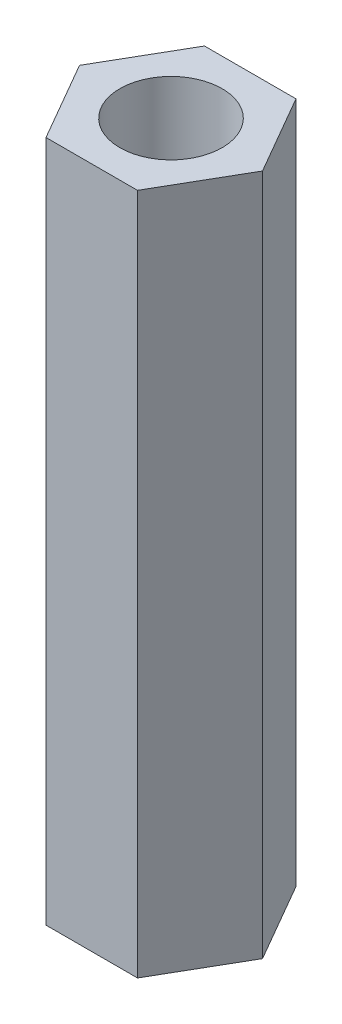
ISO-10303-21;
HEADER;
FILE_DESCRIPTION(('STEP AP214'),'2;1');
FILE_NAME('part.step','',(''),(''),'','','');
FILE_SCHEMA(('AUTOMOTIVE_DESIGN { 1 0 10303 214 1 1 1 1 }'));
ENDSEC;
DATA;
#1=APPLICATION_CONTEXT('core data for automotive mechanical design processes');
#2=APPLICATION_PROTOCOL_DEFINITION('international standard','automotive_design',2000,#1);
#3=PRODUCT_CONTEXT('',#1,'mechanical');
#4=PRODUCT('Part','Part','',(#3));
#5=PRODUCT_RELATED_PRODUCT_CATEGORY('part','',(#4));
#6=PRODUCT_DEFINITION_FORMATION('','',#4);
#7=PRODUCT_DEFINITION_CONTEXT('part definition',#1,'design');
#8=PRODUCT_DEFINITION('design','',#6,#7);
#9=PRODUCT_DEFINITION_SHAPE('','',#8);
#10=(LENGTH_UNIT() NAMED_UNIT(*) SI_UNIT(.MILLI.,.METRE.));
#11=(NAMED_UNIT(*) PLANE_ANGLE_UNIT() SI_UNIT($,.RADIAN.));
#12=(NAMED_UNIT(*) SI_UNIT($,.STERADIAN.) SOLID_ANGLE_UNIT());
#13=UNCERTAINTY_MEASURE_WITH_UNIT(LENGTH_MEASURE(1.E-05),#10,'distance_accuracy_value','');
#14=(GEOMETRIC_REPRESENTATION_CONTEXT(3) GLOBAL_UNCERTAINTY_ASSIGNED_CONTEXT((#13)) GLOBAL_UNIT_ASSIGNED_CONTEXT((#10,
#11,#12)) REPRESENTATION_CONTEXT('',''));
#15=CARTESIAN_POINT('',(0.,0.,0.));
#16=DIRECTION('',(0.,0.,1.));
#17=DIRECTION('',(1.,0.,0.));
#18=AXIS2_PLACEMENT_3D('',#15,#16,#17);
#19=CARTESIAN_POINT('',(0.,20.,0.));
#20=DIRECTION('',(0.,-1.,0.));
#21=DIRECTION('',(0.,0.,-1.));
#22=AXIS2_PLACEMENT_3D('',#19,#20,#21);
#23=PLANE('',#22);
#24=DIRECTION('',(-0.5,0.,0.866025403784439));
#25=VECTOR('',#24,1.);
#26=CARTESIAN_POINT('',(-2.68275799921944,20.,-1.11130722679764E-13));
#27=LINE('',#26,#25);
#28=CARTESIAN_POINT('',(-1.34137899960966,20.,-2.32333657953018));
#29=VERTEX_POINT('',#28);
#30=CARTESIAN_POINT('',(-2.68275799921944,20.,-1.11130722679764E-13));
#31=VERTEX_POINT('',#30);
#32=EDGE_CURVE('E132',#29,#31,#27,.T.);
#33=ORIENTED_EDGE('',*,*,#32,.T.);
#34=DIRECTION('',(0.5,0.,0.866025403784438));
#35=VECTOR('',#34,1.);
#36=CARTESIAN_POINT('',(-1.34137899960965,20.,2.32333657952995));
#37=LINE('',#36,#35);
#38=CARTESIAN_POINT('',(-1.34137899960965,20.,2.32333657952995));
#39=VERTEX_POINT('',#38);
#40=EDGE_CURVE('E90',#31,#39,#37,.T.);
#41=ORIENTED_EDGE('',*,*,#40,.T.);
#42=DIRECTION('',(1.,0.,0.));
#43=VECTOR('',#42,1.);
#44=CARTESIAN_POINT('',(1.34137899960992,20.,2.32333657952995));
#45=LINE('',#44,#43);
#46=CARTESIAN_POINT('',(1.34137899960992,20.,2.32333657952995));
#47=VERTEX_POINT('',#46);
#48=EDGE_CURVE('E103',#39,#47,#45,.T.);
#49=ORIENTED_EDGE('',*,*,#48,.T.);
#50=DIRECTION('',(0.5,0.,-0.866025403784439));
#51=VECTOR('',#50,1.);
#52=CARTESIAN_POINT('',(2.68275799921971,20.,-1.13299127024735E-13));
#53=LINE('',#52,#51);
#54=CARTESIAN_POINT('',(2.68275799921971,20.,-1.13299127024735E-13));
#55=VERTEX_POINT('',#54);
#56=EDGE_CURVE('E97',#47,#55,#53,.T.);
#57=ORIENTED_EDGE('',*,*,#56,.T.);
#58=DIRECTION('',(-0.5,0.,-0.866025403784439));
#59=VECTOR('',#58,1.);
#60=CARTESIAN_POINT('',(1.34137899960992,20.,-2.32333657953018));
#61=LINE('',#60,#59);
#62=CARTESIAN_POINT('',(1.34137899960992,20.,-2.32333657953018));
#63=VERTEX_POINT('',#62);
#64=EDGE_CURVE('E101',#55,#63,#61,.T.);
#65=ORIENTED_EDGE('',*,*,#64,.T.);
#66=DIRECTION('',(-1.,0.,0.));
#67=VECTOR('',#66,1.);
#68=CARTESIAN_POINT('',(-1.34137899960966,20.,-2.32333657953018));
#69=LINE('',#68,#67);
#70=EDGE_CURVE('E53',#63,#29,#69,.T.);
#71=ORIENTED_EDGE('',*,*,#70,.T.);
#72=EDGE_LOOP('',(#33,#41,#49,#57,#65,#71));
#73=FACE_BOUND('',#72,.T.);
#74=CARTESIAN_POINT('',(0.,20.,0.));
#75=DIRECTION('',(0.,1.,0.));
#76=DIRECTION('',(0.,0.,1.));
#77=AXIS2_PLACEMENT_3D('',#74,#75,#76);
#78=CIRCLE('',#77,1.5);
#79=CARTESIAN_POINT('',(0.,20.,1.5));
#80=VERTEX_POINT('',#79);
#81=EDGE_CURVE('E125',#80,#80,#78,.T.);
#82=ORIENTED_EDGE('',*,*,#81,.F.);
#83=EDGE_LOOP('',(#82));
#84=FACE_BOUND('',#83,.T.);
#85=ADVANCED_FACE('F36',(#73,#84),#23,.F.);
#86=CARTESIAN_POINT('',(0.,0.,0.));
#87=DIRECTION('',(0.,-1.,0.));
#88=DIRECTION('',(0.,0.,-1.));
#89=AXIS2_PLACEMENT_3D('',#86,#87,#88);
#90=PLANE('',#89);
#91=DIRECTION('',(-0.5,0.,0.866025403784439));
#92=VECTOR('',#91,1.);
#93=CARTESIAN_POINT('',(-2.68275799921944,0.,-1.11130722679764E-13));
#94=LINE('',#93,#92);
#95=CARTESIAN_POINT('',(-1.34137899960966,0.,-2.32333657953018));
#96=VERTEX_POINT('',#95);
#97=CARTESIAN_POINT('',(-2.68275799921944,0.,-1.11130722679764E-13));
#98=VERTEX_POINT('',#97);
#99=EDGE_CURVE('E121',#96,#98,#94,.T.);
#100=ORIENTED_EDGE('',*,*,#99,.F.);
#101=DIRECTION('',(-1.,0.,0.));
#102=VECTOR('',#101,1.);
#103=CARTESIAN_POINT('',(-1.34137899960966,0.,-2.32333657953018));
#104=LINE('',#103,#102);
#105=CARTESIAN_POINT('',(1.34137899960992,0.,-2.32333657953018));
#106=VERTEX_POINT('',#105);
#107=EDGE_CURVE('E82',#106,#96,#104,.T.);
#108=ORIENTED_EDGE('',*,*,#107,.F.);
#109=DIRECTION('',(-0.5,0.,-0.866025403784439));
#110=VECTOR('',#109,1.);
#111=CARTESIAN_POINT('',(1.34137899960992,0.,-2.32333657953018));
#112=LINE('',#111,#110);
#113=CARTESIAN_POINT('',(2.68275799921971,0.,-1.13299127024735E-13));
#114=VERTEX_POINT('',#113);
#115=EDGE_CURVE('E76',#114,#106,#112,.T.);
#116=ORIENTED_EDGE('',*,*,#115,.F.);
#117=DIRECTION('',(0.5,0.,-0.866025403784439));
#118=VECTOR('',#117,1.);
#119=CARTESIAN_POINT('',(2.68275799921971,0.,-1.13299127024735E-13));
#120=LINE('',#119,#118);
#121=CARTESIAN_POINT('',(1.34137899960992,0.,2.32333657952995));
#122=VERTEX_POINT('',#121);
#123=EDGE_CURVE('E111',#122,#114,#120,.T.);
#124=ORIENTED_EDGE('',*,*,#123,.F.);
#125=DIRECTION('',(1.,0.,0.));
#126=VECTOR('',#125,1.);
#127=CARTESIAN_POINT('',(1.34137899960992,0.,2.32333657952995));
#128=LINE('',#127,#126);
#129=CARTESIAN_POINT('',(-1.34137899960965,0.,2.32333657952995));
#130=VERTEX_POINT('',#129);
#131=EDGE_CURVE('E127',#130,#122,#128,.T.);
#132=ORIENTED_EDGE('',*,*,#131,.F.);
#133=DIRECTION('',(0.5,0.,0.866025403784438));
#134=VECTOR('',#133,1.);
#135=CARTESIAN_POINT('',(-1.34137899960965,0.,2.32333657952995));
#136=LINE('',#135,#134);
#137=EDGE_CURVE('E124',#98,#130,#136,.T.);
#138=ORIENTED_EDGE('',*,*,#137,.F.);
#139=EDGE_LOOP('',(#100,#108,#116,#124,#132,#138));
#140=FACE_BOUND('',#139,.T.);
#141=CARTESIAN_POINT('',(0.,0.,0.));
#142=DIRECTION('',(0.,1.,0.));
#143=DIRECTION('',(0.,0.,1.));
#144=AXIS2_PLACEMENT_3D('',#141,#142,#143);
#145=CIRCLE('',#144,1.5);
#146=CARTESIAN_POINT('',(0.,0.,1.5));
#147=VERTEX_POINT('',#146);
#148=EDGE_CURVE('E225',#147,#147,#145,.T.);
#149=ORIENTED_EDGE('',*,*,#148,.T.);
#150=EDGE_LOOP('',(#149));
#151=FACE_BOUND('',#150,.T.);
#152=ADVANCED_FACE('F141',(#140,#151),#90,.T.);
#153=CARTESIAN_POINT('',(-2.68275799921944,20.,-1.11130722679764E-13));
#154=DIRECTION('',(0.866025403784439,0.,0.5));
#155=DIRECTION('',(0.5,0.,-0.866025403784439));
#156=AXIS2_PLACEMENT_3D('',#153,#154,#155);
#157=PLANE('',#156);
#158=ORIENTED_EDGE('',*,*,#99,.T.);
#159=DIRECTION('',(0.,-1.,0.));
#160=VECTOR('',#159,1.);
#161=CARTESIAN_POINT('',(-2.68275799921944,20.,-1.11130722679764E-13));
#162=LINE('',#161,#160);
#163=EDGE_CURVE('E11',#31,#98,#162,.T.);
#164=ORIENTED_EDGE('',*,*,#163,.F.);
#165=ORIENTED_EDGE('',*,*,#32,.F.);
#166=DIRECTION('',(0.,-1.,0.));
#167=VECTOR('',#166,1.);
#168=CARTESIAN_POINT('',(-1.34137899960966,20.,-2.32333657953018));
#169=LINE('',#168,#167);
#170=EDGE_CURVE('E117',#29,#96,#169,.T.);
#171=ORIENTED_EDGE('',*,*,#170,.T.);
#172=EDGE_LOOP('',(#158,#164,#165,#171));
#173=FACE_BOUND('',#172,.T.);
#174=ADVANCED_FACE('F38',(#173),#157,.F.);
#175=CARTESIAN_POINT('',(-1.34137899960965,20.,2.32333657952995));
#176=DIRECTION('',(0.866025403784438,0.,-0.5));
#177=DIRECTION('',(-0.5,0.,-0.866025403784438));
#178=AXIS2_PLACEMENT_3D('',#175,#176,#177);
#179=PLANE('',#178);
#180=ORIENTED_EDGE('',*,*,#137,.T.);
#181=DIRECTION('',(0.,-1.,0.));
#182=VECTOR('',#181,1.);
#183=CARTESIAN_POINT('',(-1.34137899960965,20.,2.32333657952995));
#184=LINE('',#183,#182);
#185=EDGE_CURVE('E45',#39,#130,#184,.T.);
#186=ORIENTED_EDGE('',*,*,#185,.F.);
#187=ORIENTED_EDGE('',*,*,#40,.F.);
#188=ORIENTED_EDGE('',*,*,#163,.T.);
#189=EDGE_LOOP('',(#180,#186,#187,#188));
#190=FACE_BOUND('',#189,.T.);
#191=ADVANCED_FACE('F166',(#190),#179,.F.);
#192=CARTESIAN_POINT('',(1.34137899960992,20.,2.32333657952995));
#193=DIRECTION('',(0.,0.,-1.));
#194=DIRECTION('',(-1.,0.,0.));
#195=AXIS2_PLACEMENT_3D('',#192,#193,#194);
#196=PLANE('',#195);
#197=ORIENTED_EDGE('',*,*,#131,.T.);
#198=DIRECTION('',(0.,-1.,0.));
#199=VECTOR('',#198,1.);
#200=CARTESIAN_POINT('',(1.34137899960992,20.,2.32333657952995));
#201=LINE('',#200,#199);
#202=EDGE_CURVE('E112',#47,#122,#201,.T.);
#203=ORIENTED_EDGE('',*,*,#202,.F.);
#204=ORIENTED_EDGE('',*,*,#48,.F.);
#205=ORIENTED_EDGE('',*,*,#185,.T.);
#206=EDGE_LOOP('',(#197,#203,#204,#205));
#207=FACE_BOUND('',#206,.T.);
#208=ADVANCED_FACE('F138',(#207),#196,.F.);
#209=CARTESIAN_POINT('',(2.68275799921971,20.,-1.13299127024735E-13));
#210=DIRECTION('',(-0.866025403784439,0.,-0.5));
#211=DIRECTION('',(-0.5,0.,0.866025403784439));
#212=AXIS2_PLACEMENT_3D('',#209,#210,#211);
#213=PLANE('',#212);
#214=ORIENTED_EDGE('',*,*,#123,.T.);
#215=DIRECTION('',(0.,-1.,0.));
#216=VECTOR('',#215,1.);
#217=CARTESIAN_POINT('',(2.68275799921971,20.,-1.13299127024735E-13));
#218=LINE('',#217,#216);
#219=EDGE_CURVE('E108',#55,#114,#218,.T.);
#220=ORIENTED_EDGE('',*,*,#219,.F.);
#221=ORIENTED_EDGE('',*,*,#56,.F.);
#222=ORIENTED_EDGE('',*,*,#202,.T.);
#223=EDGE_LOOP('',(#214,#220,#221,#222));
#224=FACE_BOUND('',#223,.T.);
#225=ADVANCED_FACE('F109',(#224),#213,.F.);
#226=CARTESIAN_POINT('',(1.34137899960992,20.,-2.32333657953018));
#227=DIRECTION('',(-0.866025403784439,0.,0.5));
#228=DIRECTION('',(0.5,0.,0.866025403784439));
#229=AXIS2_PLACEMENT_3D('',#226,#227,#228);
#230=PLANE('',#229);
#231=ORIENTED_EDGE('',*,*,#115,.T.);
#232=DIRECTION('',(0.,-1.,0.));
#233=VECTOR('',#232,1.);
#234=CARTESIAN_POINT('',(1.34137899960992,20.,-2.32333657953018));
#235=LINE('',#234,#233);
#236=EDGE_CURVE('E113',#63,#106,#235,.T.);
#237=ORIENTED_EDGE('',*,*,#236,.F.);
#238=ORIENTED_EDGE('',*,*,#64,.F.);
#239=ORIENTED_EDGE('',*,*,#219,.T.);
#240=EDGE_LOOP('',(#231,#237,#238,#239));
#241=FACE_BOUND('',#240,.T.);
#242=ADVANCED_FACE('F115',(#241),#230,.F.);
#243=CARTESIAN_POINT('',(-1.34137899960966,20.,-2.32333657953018));
#244=DIRECTION('',(0.,0.,1.));
#245=DIRECTION('',(1.,0.,0.));
#246=AXIS2_PLACEMENT_3D('',#243,#244,#245);
#247=PLANE('',#246);
#248=ORIENTED_EDGE('',*,*,#107,.T.);
#249=ORIENTED_EDGE('',*,*,#170,.F.);
#250=ORIENTED_EDGE('',*,*,#70,.F.);
#251=ORIENTED_EDGE('',*,*,#236,.T.);
#252=EDGE_LOOP('',(#248,#249,#250,#251));
#253=FACE_BOUND('',#252,.T.);
#254=ADVANCED_FACE('F146',(#253),#247,.F.);
#255=CARTESIAN_POINT('',(0.,20.,0.));
#256=DIRECTION('',(0.,-1.,0.));
#257=DIRECTION('',(0.,0.,-1.));
#258=AXIS2_PLACEMENT_3D('',#255,#256,#257);
#259=CYLINDRICAL_SURFACE('',#258,1.5);
#260=ORIENTED_EDGE('',*,*,#81,.T.);
#261=EDGE_LOOP('',(#260));
#262=FACE_BOUND('',#261,.T.);
#263=ORIENTED_EDGE('',*,*,#148,.F.);
#264=EDGE_LOOP('',(#263));
#265=FACE_BOUND('',#264,.T.);
#266=ADVANCED_FACE('F148',(#262,#265),#259,.F.);
#267=CLOSED_SHELL('',(#85,#152,#174,#191,#208,#225,#242,#254,#266));
#268=MANIFOLD_SOLID_BREP('B2',#267);
#269=ADVANCED_BREP_SHAPE_REPRESENTATION('',(#18,#268),#14);
#270=SHAPE_DEFINITION_REPRESENTATION(#9,#269);
ENDSEC;
END-ISO-10303-21;
